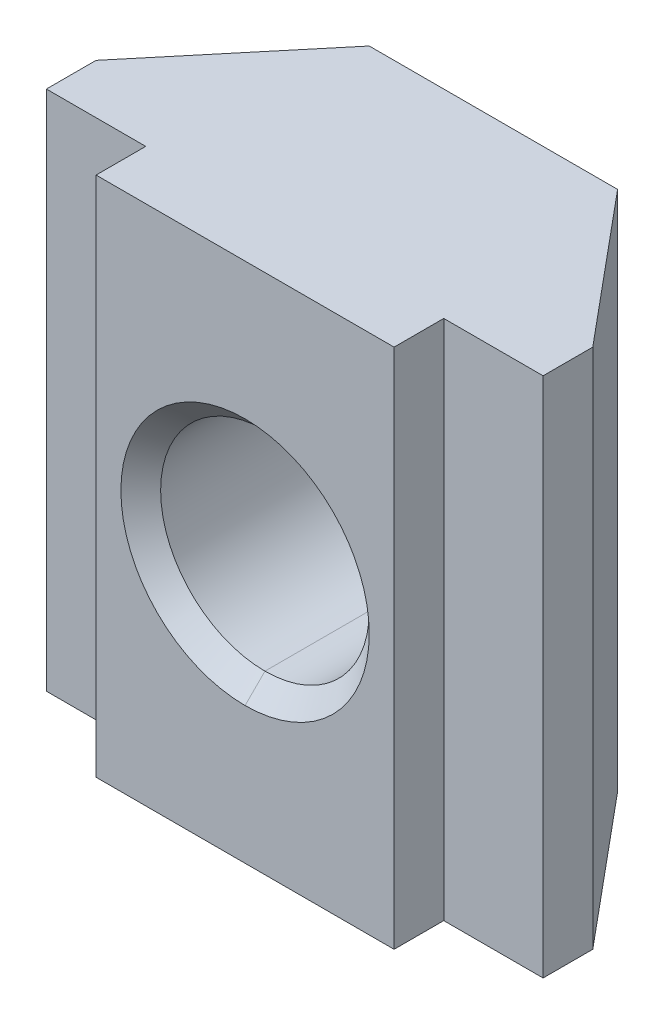
ISO-10303-21;
HEADER;
FILE_DESCRIPTION(('STEP AP214'),'2;1');
FILE_NAME('part.step','',(''),(''),'','','');
FILE_SCHEMA(('AUTOMOTIVE_DESIGN { 1 0 10303 214 1 1 1 1 }'));
ENDSEC;
DATA;
#1=APPLICATION_CONTEXT('core data for automotive mechanical design processes');
#2=APPLICATION_PROTOCOL_DEFINITION('international standard','automotive_design',2000,#1);
#3=PRODUCT_CONTEXT('',#1,'mechanical');
#4=PRODUCT('Part','Part','',(#3));
#5=PRODUCT_RELATED_PRODUCT_CATEGORY('part','',(#4));
#6=PRODUCT_DEFINITION_FORMATION('','',#4);
#7=PRODUCT_DEFINITION_CONTEXT('part definition',#1,'design');
#8=PRODUCT_DEFINITION('design','',#6,#7);
#9=PRODUCT_DEFINITION_SHAPE('','',#8);
#10=(LENGTH_UNIT() NAMED_UNIT(*) SI_UNIT(.MILLI.,.METRE.));
#11=(NAMED_UNIT(*) PLANE_ANGLE_UNIT() SI_UNIT($,.RADIAN.));
#12=(NAMED_UNIT(*) SI_UNIT($,.STERADIAN.) SOLID_ANGLE_UNIT());
#13=UNCERTAINTY_MEASURE_WITH_UNIT(LENGTH_MEASURE(1.E-05),#10,'distance_accuracy_value','');
#14=(GEOMETRIC_REPRESENTATION_CONTEXT(3) GLOBAL_UNCERTAINTY_ASSIGNED_CONTEXT((#13)) GLOBAL_UNIT_ASSIGNED_CONTEXT((#10,
#11,#12)) REPRESENTATION_CONTEXT('',''));
#15=CARTESIAN_POINT('',(0.,0.,0.));
#16=DIRECTION('',(0.,0.,1.));
#17=DIRECTION('',(1.,0.,0.));
#18=AXIS2_PLACEMENT_3D('',#15,#16,#17);
#19=CARTESIAN_POINT('',(5.,5.25,0.));
#20=DIRECTION('',(1.,0.,0.));
#21=DIRECTION('',(0.,1.,0.));
#22=AXIS2_PLACEMENT_3D('',#19,#20,#21);
#23=PLANE('',#22);
#24=DIRECTION('',(0.,-1.,0.));
#25=VECTOR('',#24,1.);
#26=CARTESIAN_POINT('',(5.,5.25,0.));
#27=LINE('',#26,#25);
#28=CARTESIAN_POINT('',(5.,5.25,0.));
#29=VERTEX_POINT('',#28);
#30=CARTESIAN_POINT('',(5.,-5.25,0.));
#31=VERTEX_POINT('',#30);
#32=EDGE_CURVE('E25',#29,#31,#27,.T.);
#33=ORIENTED_EDGE('',*,*,#32,.T.);
#34=DIRECTION('',(0.,0.,-1.));
#35=VECTOR('',#34,1.);
#36=CARTESIAN_POINT('',(5.,-5.25,0.));
#37=LINE('',#36,#35);
#38=CARTESIAN_POINT('',(5.,-5.25,-1.));
#39=VERTEX_POINT('',#38);
#40=EDGE_CURVE('E195',#31,#39,#37,.T.);
#41=ORIENTED_EDGE('',*,*,#40,.T.);
#42=DIRECTION('',(0.,-1.,0.));
#43=VECTOR('',#42,1.);
#44=CARTESIAN_POINT('',(5.,5.25,-1.));
#45=LINE('',#44,#43);
#46=CARTESIAN_POINT('',(5.,5.25,-1.));
#47=VERTEX_POINT('',#46);
#48=EDGE_CURVE('E11',#47,#39,#45,.T.);
#49=ORIENTED_EDGE('',*,*,#48,.F.);
#50=DIRECTION('',(0.,0.,1.));
#51=VECTOR('',#50,1.);
#52=CARTESIAN_POINT('',(5.,5.25,0.));
#53=LINE('',#52,#51);
#54=EDGE_CURVE('E304',#47,#29,#53,.T.);
#55=ORIENTED_EDGE('',*,*,#54,.T.);
#56=EDGE_LOOP('',(#33,#41,#49,#55));
#57=FACE_BOUND('',#56,.T.);
#58=ADVANCED_FACE('F17',(#57),#23,.T.);
#59=CARTESIAN_POINT('',(-5.,5.25,0.));
#60=DIRECTION('',(1.,0.,0.));
#61=DIRECTION('',(0.,1.,0.));
#62=AXIS2_PLACEMENT_3D('',#59,#60,#61);
#63=PLANE('',#62);
#64=DIRECTION('',(0.,0.,-1.));
#65=VECTOR('',#64,1.);
#66=CARTESIAN_POINT('',(-5.,-5.25,0.));
#67=LINE('',#66,#65);
#68=CARTESIAN_POINT('',(-5.,-5.25,0.));
#69=VERTEX_POINT('',#68);
#70=CARTESIAN_POINT('',(-5.,-5.25,-1.));
#71=VERTEX_POINT('',#70);
#72=EDGE_CURVE('E265',#69,#71,#67,.T.);
#73=ORIENTED_EDGE('',*,*,#72,.F.);
#74=DIRECTION('',(0.,1.,0.));
#75=VECTOR('',#74,1.);
#76=CARTESIAN_POINT('',(-5.,5.25,0.));
#77=LINE('',#76,#75);
#78=CARTESIAN_POINT('',(-5.,5.25,0.));
#79=VERTEX_POINT('',#78);
#80=EDGE_CURVE('E312',#69,#79,#77,.T.);
#81=ORIENTED_EDGE('',*,*,#80,.T.);
#82=DIRECTION('',(0.,0.,1.));
#83=VECTOR('',#82,1.);
#84=CARTESIAN_POINT('',(-5.,5.25,0.));
#85=LINE('',#84,#83);
#86=CARTESIAN_POINT('',(-5.,5.25,-1.));
#87=VERTEX_POINT('',#86);
#88=EDGE_CURVE('E290',#87,#79,#85,.T.);
#89=ORIENTED_EDGE('',*,*,#88,.F.);
#90=DIRECTION('',(0.,-1.,0.));
#91=VECTOR('',#90,1.);
#92=CARTESIAN_POINT('',(-5.,5.25,-1.));
#93=LINE('',#92,#91);
#94=EDGE_CURVE('E322',#87,#71,#93,.T.);
#95=ORIENTED_EDGE('',*,*,#94,.T.);
#96=EDGE_LOOP('',(#73,#81,#89,#95));
#97=FACE_BOUND('',#96,.T.);
#98=ADVANCED_FACE('F476',(#97),#63,.F.);
#99=CARTESIAN_POINT('',(0.,0.,-4.00000000013279));
#100=DIRECTION('',(0.,0.,-1.));
#101=DIRECTION('',(0.,1.,0.));
#102=AXIS2_PLACEMENT_3D('',#99,#100,#101);
#103=CONICAL_SURFACE('',#102,2.50000000011141,0.785398163539558);
#104=DIRECTION('',(0.,-0.707106781287035,-0.70710678108606));
#105=VECTOR('',#104,1.);
#106=CARTESIAN_POINT('',(0.,-2.50000000011142,-4.00000000013278));
#107=LINE('',#106,#105);
#108=CARTESIAN_POINT('',(0.,-2.1,-3.6));
#109=VERTEX_POINT('',#108);
#110=CARTESIAN_POINT('',(0.,-2.49999999999773,-4.00000000001909));
#111=VERTEX_POINT('',#110);
#112=EDGE_CURVE('E215',#109,#111,#107,.T.);
#113=ORIENTED_EDGE('',*,*,#112,.F.);
#114=CARTESIAN_POINT('',(0.,0.,-3.6));
#115=DIRECTION('',(0.,0.,1.));
#116=DIRECTION('',(0.,1.,0.));
#117=AXIS2_PLACEMENT_3D('',#114,#115,#116);
#118=CIRCLE('',#117,2.1);
#119=CARTESIAN_POINT('',(0.,2.1,-3.6));
#120=VERTEX_POINT('',#119);
#121=EDGE_CURVE('E303',#109,#120,#118,.T.);
#122=ORIENTED_EDGE('',*,*,#121,.T.);
#123=DIRECTION('',(0.,0.707106781287033,-0.707106781086062));
#124=VECTOR('',#123,1.);
#125=CARTESIAN_POINT('',(0.,2.50000000011141,-4.00000000013279));
#126=LINE('',#125,#124);
#127=CARTESIAN_POINT('',(0.,2.49999999999772,-4.00000000001909));
#128=VERTEX_POINT('',#127);
#129=EDGE_CURVE('E222',#120,#128,#126,.T.);
#130=ORIENTED_EDGE('',*,*,#129,.T.);
#131=CARTESIAN_POINT('',(0.,0.,-4.00000000001909));
#132=DIRECTION('',(0.,0.,-1.));
#133=DIRECTION('',(0.,1.,0.));
#134=AXIS2_PLACEMENT_3D('',#131,#132,#133);
#135=CIRCLE('',#134,2.49999999999772);
#136=CARTESIAN_POINT('',(2.50000000000042,0.,-4.00000000001909));
#137=VERTEX_POINT('',#136);
#138=EDGE_CURVE('E318',#128,#137,#135,.T.);
#139=ORIENTED_EDGE('',*,*,#138,.T.);
#140=EDGE_CURVE('E274',#137,#111,#135,.T.);
#141=ORIENTED_EDGE('',*,*,#140,.T.);
#142=EDGE_LOOP('',(#113,#122,#130,#139,#141));
#143=FACE_BOUND('',#142,.T.);
#144=ADVANCED_FACE('F513',(#143),#103,.F.);
#145=CARTESIAN_POINT('',(5.,5.25,-1.));
#146=DIRECTION('',(0.768221279597458,0.,-0.640184399664382));
#147=DIRECTION('',(0.,-1.,0.));
#148=AXIS2_PLACEMENT_3D('',#145,#146,#147);
#149=PLANE('',#148);
#150=ORIENTED_EDGE('',*,*,#48,.T.);
#151=DIRECTION('',(0.640184399664441,0.,0.768221279597409));
#152=VECTOR('',#151,1.);
#153=CARTESIAN_POINT('',(2.50000000000019,-5.25,-4.00000000000008));
#154=LINE('',#153,#152);
#155=CARTESIAN_POINT('',(2.50000000000031,-5.25,-4.00000000000013));
#156=VERTEX_POINT('',#155);
#157=EDGE_CURVE('E250',#156,#39,#154,.T.);
#158=ORIENTED_EDGE('',*,*,#157,.F.);
#159=DIRECTION('',(0.,1.,0.));
#160=VECTOR('',#159,1.);
#161=CARTESIAN_POINT('',(2.50000000000042,5.25,-4.00000000000028));
#162=LINE('',#161,#160);
#163=CARTESIAN_POINT('',(2.50000000000042,0.,-4.00000000001909));
#164=VERTEX_POINT('',#163);
#165=EDGE_CURVE('E270',#156,#164,#162,.T.);
#166=ORIENTED_EDGE('',*,*,#165,.T.);
#167=CARTESIAN_POINT('',(2.50000000000034,5.25,-4.00000000000007));
#168=VERTEX_POINT('',#167);
#169=EDGE_CURVE('E275',#164,#168,#162,.T.);
#170=ORIENTED_EDGE('',*,*,#169,.T.);
#171=DIRECTION('',(0.640184399664441,0.,0.768221279597408));
#172=VECTOR('',#171,1.);
#173=CARTESIAN_POINT('',(2.50000000000019,5.25,-4.00000000000008));
#174=LINE('',#173,#172);
#175=EDGE_CURVE('E299',#168,#47,#174,.T.);
#176=ORIENTED_EDGE('',*,*,#175,.T.);
#177=EDGE_LOOP('',(#150,#158,#166,#170,#176));
#178=FACE_BOUND('',#177,.T.);
#179=ADVANCED_FACE('F484',(#178),#149,.T.);
#180=CARTESIAN_POINT('',(5.,5.25,0.));
#181=DIRECTION('',(0.,0.,-1.));
#182=DIRECTION('',(0.,-1.,0.));
#183=AXIS2_PLACEMENT_3D('',#180,#181,#182);
#184=PLANE('',#183);
#185=DIRECTION('',(-1.,0.,0.));
#186=VECTOR('',#185,1.);
#187=CARTESIAN_POINT('',(0.,-5.25,0.));
#188=LINE('',#187,#186);
#189=CARTESIAN_POINT('',(3.,-5.25,0.));
#190=VERTEX_POINT('',#189);
#191=EDGE_CURVE('E254',#31,#190,#188,.T.);
#192=ORIENTED_EDGE('',*,*,#191,.F.);
#193=ORIENTED_EDGE('',*,*,#32,.F.);
#194=DIRECTION('',(-1.,0.,0.));
#195=VECTOR('',#194,1.);
#196=CARTESIAN_POINT('',(0.,5.25,0.));
#197=LINE('',#196,#195);
#198=CARTESIAN_POINT('',(3.,5.25,0.));
#199=VERTEX_POINT('',#198);
#200=EDGE_CURVE('E298',#29,#199,#197,.T.);
#201=ORIENTED_EDGE('',*,*,#200,.T.);
#202=DIRECTION('',(0.,-1.,0.));
#203=VECTOR('',#202,1.);
#204=CARTESIAN_POINT('',(3.,5.25,0.));
#205=LINE('',#204,#203);
#206=EDGE_CURVE('E269',#199,#190,#205,.T.);
#207=ORIENTED_EDGE('',*,*,#206,.T.);
#208=EDGE_LOOP('',(#192,#193,#201,#207));
#209=FACE_BOUND('',#208,.T.);
#210=ADVANCED_FACE('F334',(#209),#184,.F.);
#211=CARTESIAN_POINT('',(-5.,5.25,-1.));
#212=DIRECTION('',(0.768221279597458,0.,0.640184399664382));
#213=DIRECTION('',(0.,-1.,0.));
#214=AXIS2_PLACEMENT_3D('',#211,#212,#213);
#215=PLANE('',#214);
#216=DIRECTION('',(0.,-1.,0.));
#217=VECTOR('',#216,1.);
#218=CARTESIAN_POINT('',(-2.50000000000042,5.25,-4.00000000000028));
#219=LINE('',#218,#217);
#220=CARTESIAN_POINT('',(-2.50000000000034,5.25,-4.00000000000007));
#221=VERTEX_POINT('',#220);
#222=CARTESIAN_POINT('',(-2.50000000000042,0.,-4.00000000001909));
#223=VERTEX_POINT('',#222);
#224=EDGE_CURVE('E315',#221,#223,#219,.T.);
#225=ORIENTED_EDGE('',*,*,#224,.T.);
#226=CARTESIAN_POINT('',(-2.50000000000031,-5.25,-4.00000000000013));
#227=VERTEX_POINT('',#226);
#228=EDGE_CURVE('E32',#223,#227,#219,.T.);
#229=ORIENTED_EDGE('',*,*,#228,.T.);
#230=DIRECTION('',(0.640184399664441,0.,-0.768221279597409));
#231=VECTOR('',#230,1.);
#232=CARTESIAN_POINT('',(-5.,-5.25,-1.));
#233=LINE('',#232,#231);
#234=EDGE_CURVE('E242',#71,#227,#233,.T.);
#235=ORIENTED_EDGE('',*,*,#234,.F.);
#236=ORIENTED_EDGE('',*,*,#94,.F.);
#237=DIRECTION('',(0.640184399664441,0.,-0.768221279597408));
#238=VECTOR('',#237,1.);
#239=CARTESIAN_POINT('',(-5.,5.25,-1.));
#240=LINE('',#239,#238);
#241=EDGE_CURVE('E286',#87,#221,#240,.T.);
#242=ORIENTED_EDGE('',*,*,#241,.T.);
#243=EDGE_LOOP('',(#225,#229,#235,#236,#242));
#244=FACE_BOUND('',#243,.T.);
#245=ADVANCED_FACE('F472',(#244),#215,.F.);
#246=CARTESIAN_POINT('',(-2.5,5.25,-4.));
#247=DIRECTION('',(0.,0.,1.));
#248=DIRECTION('',(0.,-1.,0.));
#249=AXIS2_PLACEMENT_3D('',#246,#247,#248);
#250=PLANE('',#249);
#251=ORIENTED_EDGE('',*,*,#138,.F.);
#252=CARTESIAN_POINT('',(0.,0.,-4.00000000001909));
#253=DIRECTION('',(0.,0.,-1.));
#254=DIRECTION('',(0.,1.,0.));
#255=AXIS2_PLACEMENT_3D('',#252,#253,#254);
#256=CIRCLE('',#255,2.49999999999772);
#257=CARTESIAN_POINT('',(-2.50000000000042,0.,-4.00000000001909));
#258=VERTEX_POINT('',#257);
#259=EDGE_CURVE('E40',#258,#128,#256,.T.);
#260=ORIENTED_EDGE('',*,*,#259,.F.);
#261=EDGE_CURVE('E219',#111,#258,#256,.T.);
#262=ORIENTED_EDGE('',*,*,#261,.F.);
#263=ORIENTED_EDGE('',*,*,#140,.F.);
#264=EDGE_LOOP('',(#251,#260,#262,#263));
#265=FACE_BOUND('',#264,.T.);
#266=DIRECTION('',(1.,0.,0.));
#267=VECTOR('',#266,1.);
#268=CARTESIAN_POINT('',(0.,-5.25,-4.00000000000008));
#269=LINE('',#268,#267);
#270=EDGE_CURVE('E246',#227,#156,#269,.T.);
#271=ORIENTED_EDGE('',*,*,#270,.F.);
#272=ORIENTED_EDGE('',*,*,#228,.F.);
#273=ORIENTED_EDGE('',*,*,#224,.F.);
#274=DIRECTION('',(1.,0.,0.));
#275=VECTOR('',#274,1.);
#276=CARTESIAN_POINT('',(-2.5,5.25,-4.));
#277=LINE('',#276,#275);
#278=EDGE_CURVE('E282',#221,#168,#277,.T.);
#279=ORIENTED_EDGE('',*,*,#278,.T.);
#280=ORIENTED_EDGE('',*,*,#169,.F.);
#281=ORIENTED_EDGE('',*,*,#165,.F.);
#282=EDGE_LOOP('',(#271,#272,#273,#279,#280,#281));
#283=FACE_BOUND('',#282,.T.);
#284=ADVANCED_FACE('F473',(#265,#283),#250,.F.);
#285=CARTESIAN_POINT('',(-3.,5.25,0.));
#286=DIRECTION('',(0.,0.,-1.));
#287=DIRECTION('',(0.,-1.,0.));
#288=AXIS2_PLACEMENT_3D('',#285,#286,#287);
#289=PLANE('',#288);
#290=DIRECTION('',(-1.,0.,0.));
#291=VECTOR('',#290,1.);
#292=CARTESIAN_POINT('',(0.,-5.25,0.));
#293=LINE('',#292,#291);
#294=CARTESIAN_POINT('',(-3.,-5.25,0.));
#295=VERTEX_POINT('',#294);
#296=EDGE_CURVE('E261',#295,#69,#293,.T.);
#297=ORIENTED_EDGE('',*,*,#296,.F.);
#298=DIRECTION('',(0.,1.,0.));
#299=VECTOR('',#298,1.);
#300=CARTESIAN_POINT('',(-3.,5.25,0.));
#301=LINE('',#300,#299);
#302=CARTESIAN_POINT('',(-3.,5.25,0.));
#303=VERTEX_POINT('',#302);
#304=EDGE_CURVE('E238',#295,#303,#301,.T.);
#305=ORIENTED_EDGE('',*,*,#304,.T.);
#306=DIRECTION('',(-1.,0.,0.));
#307=VECTOR('',#306,1.);
#308=CARTESIAN_POINT('',(0.,5.25,0.));
#309=LINE('',#308,#307);
#310=EDGE_CURVE('E294',#303,#79,#309,.T.);
#311=ORIENTED_EDGE('',*,*,#310,.T.);
#312=ORIENTED_EDGE('',*,*,#80,.F.);
#313=EDGE_LOOP('',(#297,#305,#311,#312));
#314=FACE_BOUND('',#313,.T.);
#315=ADVANCED_FACE('F496',(#314),#289,.F.);
#316=CARTESIAN_POINT('',(0.,0.,1.));
#317=DIRECTION('',(0.,0.,-1.));
#318=DIRECTION('',(0.,1.,0.));
#319=AXIS2_PLACEMENT_3D('',#316,#317,#318);
#320=CYLINDRICAL_SURFACE('',#319,2.1);
#321=DIRECTION('',(0.,0.,-1.));
#322=VECTOR('',#321,1.);
#323=CARTESIAN_POINT('',(0.,-2.1,1.));
#324=LINE('',#323,#322);
#325=CARTESIAN_POINT('',(0.,-2.09999999992761,0.600000000076762));
#326=VERTEX_POINT('',#325);
#327=EDGE_CURVE('E182',#326,#109,#324,.T.);
#328=ORIENTED_EDGE('',*,*,#327,.F.);
#329=CARTESIAN_POINT('',(0.,0.,0.600000000076759));
#330=DIRECTION('',(0.,0.,1.));
#331=DIRECTION('',(0.,-1.,0.));
#332=AXIS2_PLACEMENT_3D('',#329,#330,#331);
#333=CIRCLE('',#332,2.09999999992761);
#334=CARTESIAN_POINT('',(0.,2.09999999992761,0.600000000076757));
#335=VERTEX_POINT('',#334);
#336=EDGE_CURVE('E171',#326,#335,#333,.T.);
#337=ORIENTED_EDGE('',*,*,#336,.T.);
#338=DIRECTION('',(0.,0.,-1.));
#339=VECTOR('',#338,1.);
#340=CARTESIAN_POINT('',(0.,2.1,1.));
#341=LINE('',#340,#339);
#342=EDGE_CURVE('E211',#335,#120,#341,.T.);
#343=ORIENTED_EDGE('',*,*,#342,.T.);
#344=ORIENTED_EDGE('',*,*,#121,.F.);
#345=EDGE_LOOP('',(#328,#337,#343,#344));
#346=FACE_BOUND('',#345,.T.);
#347=ADVANCED_FACE('F498',(#346),#320,.F.);
#348=CARTESIAN_POINT('',(0.,5.25,-1.250477880476));
#349=DIRECTION('',(0.,-1.,0.));
#350=DIRECTION('',(-1.,0.,0.));
#351=AXIS2_PLACEMENT_3D('',#348,#349,#350);
#352=PLANE('',#351);
#353=ORIENTED_EDGE('',*,*,#278,.F.);
#354=ORIENTED_EDGE('',*,*,#241,.F.);
#355=ORIENTED_EDGE('',*,*,#88,.T.);
#356=ORIENTED_EDGE('',*,*,#310,.F.);
#357=DIRECTION('',(0.,0.,1.));
#358=VECTOR('',#357,1.);
#359=CARTESIAN_POINT('',(-3.,5.25,1.));
#360=LINE('',#359,#358);
#361=CARTESIAN_POINT('',(-3.,5.25,1.));
#362=VERTEX_POINT('',#361);
#363=EDGE_CURVE('E235',#303,#362,#360,.T.);
#364=ORIENTED_EDGE('',*,*,#363,.T.);
#365=DIRECTION('',(1.,0.,0.));
#366=VECTOR('',#365,1.);
#367=CARTESIAN_POINT('',(3.,5.25,1.));
#368=LINE('',#367,#366);
#369=CARTESIAN_POINT('',(3.,5.25,1.));
#370=VERTEX_POINT('',#369);
#371=EDGE_CURVE('E202',#362,#370,#368,.T.);
#372=ORIENTED_EDGE('',*,*,#371,.T.);
#373=DIRECTION('',(0.,0.,-1.));
#374=VECTOR('',#373,1.);
#375=CARTESIAN_POINT('',(3.,5.25,0.));
#376=LINE('',#375,#374);
#377=EDGE_CURVE('E278',#370,#199,#376,.T.);
#378=ORIENTED_EDGE('',*,*,#377,.T.);
#379=ORIENTED_EDGE('',*,*,#200,.F.);
#380=ORIENTED_EDGE('',*,*,#54,.F.);
#381=ORIENTED_EDGE('',*,*,#175,.F.);
#382=EDGE_LOOP('',(#353,#354,#355,#356,#364,#372,#378,#379,#380,#381));
#383=FACE_BOUND('',#382,.T.);
#384=ADVANCED_FACE('F482',(#383),#352,.F.);
#385=CARTESIAN_POINT('',(3.,5.25,0.));
#386=DIRECTION('',(-1.,0.,0.));
#387=DIRECTION('',(0.,0.,1.));
#388=AXIS2_PLACEMENT_3D('',#385,#386,#387);
#389=PLANE('',#388);
#390=DIRECTION('',(0.,0.,1.));
#391=VECTOR('',#390,1.);
#392=CARTESIAN_POINT('',(3.,-5.25,-1.250477880476));
#393=LINE('',#392,#391);
#394=CARTESIAN_POINT('',(3.,-5.25,1.));
#395=VERTEX_POINT('',#394);
#396=EDGE_CURVE('E258',#190,#395,#393,.T.);
#397=ORIENTED_EDGE('',*,*,#396,.F.);
#398=ORIENTED_EDGE('',*,*,#206,.F.);
#399=ORIENTED_EDGE('',*,*,#377,.F.);
#400=DIRECTION('',(0.,-1.,0.));
#401=VECTOR('',#400,1.);
#402=CARTESIAN_POINT('',(3.,5.25,1.));
#403=LINE('',#402,#401);
#404=EDGE_CURVE('E198',#370,#395,#403,.T.);
#405=ORIENTED_EDGE('',*,*,#404,.T.);
#406=EDGE_LOOP('',(#397,#398,#399,#405));
#407=FACE_BOUND('',#406,.T.);
#408=ADVANCED_FACE('F488',(#407),#389,.F.);
#409=CARTESIAN_POINT('',(0.,-5.25,-1.250477880476));
#410=DIRECTION('',(0.,-1.,0.));
#411=DIRECTION('',(-1.,0.,0.));
#412=AXIS2_PLACEMENT_3D('',#409,#410,#411);
#413=PLANE('',#412);
#414=ORIENTED_EDGE('',*,*,#234,.T.);
#415=ORIENTED_EDGE('',*,*,#270,.T.);
#416=ORIENTED_EDGE('',*,*,#157,.T.);
#417=ORIENTED_EDGE('',*,*,#40,.F.);
#418=ORIENTED_EDGE('',*,*,#191,.T.);
#419=ORIENTED_EDGE('',*,*,#396,.T.);
#420=DIRECTION('',(-1.,0.,0.));
#421=VECTOR('',#420,1.);
#422=CARTESIAN_POINT('',(3.,-5.25,1.));
#423=LINE('',#422,#421);
#424=CARTESIAN_POINT('',(-3.,-5.25,1.));
#425=VERTEX_POINT('',#424);
#426=EDGE_CURVE('E203',#395,#425,#423,.T.);
#427=ORIENTED_EDGE('',*,*,#426,.T.);
#428=DIRECTION('',(0.,0.,-1.));
#429=VECTOR('',#428,1.);
#430=CARTESIAN_POINT('',(-3.,-5.25,1.));
#431=LINE('',#430,#429);
#432=EDGE_CURVE('E231',#425,#295,#431,.T.);
#433=ORIENTED_EDGE('',*,*,#432,.T.);
#434=ORIENTED_EDGE('',*,*,#296,.T.);
#435=ORIENTED_EDGE('',*,*,#72,.T.);
#436=EDGE_LOOP('',(#414,#415,#416,#417,#418,#419,#427,#433,#434,#435));
#437=FACE_BOUND('',#436,.T.);
#438=ADVANCED_FACE('F338',(#437),#413,.T.);
#439=CARTESIAN_POINT('',(-3.,5.25,1.));
#440=DIRECTION('',(1.,0.,0.));
#441=DIRECTION('',(0.,1.,0.));
#442=AXIS2_PLACEMENT_3D('',#439,#440,#441);
#443=PLANE('',#442);
#444=ORIENTED_EDGE('',*,*,#432,.F.);
#445=DIRECTION('',(0.,1.,0.));
#446=VECTOR('',#445,1.);
#447=CARTESIAN_POINT('',(-3.,5.25,1.));
#448=LINE('',#447,#446);
#449=EDGE_CURVE('E172',#425,#362,#448,.T.);
#450=ORIENTED_EDGE('',*,*,#449,.T.);
#451=ORIENTED_EDGE('',*,*,#363,.F.);
#452=ORIENTED_EDGE('',*,*,#304,.F.);
#453=EDGE_LOOP('',(#444,#450,#451,#452));
#454=FACE_BOUND('',#453,.T.);
#455=ADVANCED_FACE('F493',(#454),#443,.F.);
#456=CARTESIAN_POINT('',(0.,0.,1.00000000003319));
#457=DIRECTION('',(0.,0.,1.));
#458=DIRECTION('',(0.,-1.,0.));
#459=AXIS2_PLACEMENT_3D('',#456,#457,#458);
#460=CONICAL_SURFACE('',#459,2.49999999994089,0.785398163468503);
#461=DIRECTION('',(0.,0.707106781236792,0.707106781136303));
#462=VECTOR('',#461,1.);
#463=CARTESIAN_POINT('',(0.,2.49999999994089,1.00000000003319));
#464=LINE('',#463,#462);
#465=CARTESIAN_POINT('',(0.,2.49999999999772,1.00000000009003));
#466=VERTEX_POINT('',#465);
#467=EDGE_CURVE('E185',#335,#466,#464,.T.);
#468=ORIENTED_EDGE('',*,*,#467,.F.);
#469=ORIENTED_EDGE('',*,*,#336,.F.);
#470=DIRECTION('',(0.,-0.707106781236791,0.707106781136304));
#471=VECTOR('',#470,1.);
#472=CARTESIAN_POINT('',(0.,-2.49999999994089,1.0000000000332));
#473=LINE('',#472,#471);
#474=CARTESIAN_POINT('',(0.,-2.49999999999772,1.00000000009004));
#475=VERTEX_POINT('',#474);
#476=EDGE_CURVE('E175',#326,#475,#473,.T.);
#477=ORIENTED_EDGE('',*,*,#476,.T.);
#478=CARTESIAN_POINT('',(0.,0.,1.00000000009004));
#479=DIRECTION('',(0.,0.,1.));
#480=DIRECTION('',(0.,-1.,0.));
#481=AXIS2_PLACEMENT_3D('',#478,#479,#480);
#482=CIRCLE('',#481,2.49999999999772);
#483=EDGE_CURVE('E161',#475,#466,#482,.T.);
#484=ORIENTED_EDGE('',*,*,#483,.T.);
#485=EDGE_LOOP('',(#468,#469,#477,#484));
#486=FACE_BOUND('',#485,.T.);
#487=ADVANCED_FACE('F176',(#486),#460,.F.);
#488=CARTESIAN_POINT('',(3.,5.25,1.));
#489=DIRECTION('',(0.,0.,-1.));
#490=DIRECTION('',(0.,-1.,0.));
#491=AXIS2_PLACEMENT_3D('',#488,#489,#490);
#492=PLANE('',#491);
#493=ORIENTED_EDGE('',*,*,#483,.F.);
#494=CARTESIAN_POINT('',(0.,0.,1.00000000009004));
#495=DIRECTION('',(0.,0.,1.));
#496=DIRECTION('',(0.,-1.,0.));
#497=AXIS2_PLACEMENT_3D('',#494,#495,#496);
#498=CIRCLE('',#497,2.49999999999772);
#499=EDGE_CURVE('E166',#466,#475,#498,.T.);
#500=ORIENTED_EDGE('',*,*,#499,.F.);
#501=EDGE_LOOP('',(#493,#500));
#502=FACE_BOUND('',#501,.T.);
#503=ORIENTED_EDGE('',*,*,#426,.F.);
#504=ORIENTED_EDGE('',*,*,#404,.F.);
#505=ORIENTED_EDGE('',*,*,#371,.F.);
#506=ORIENTED_EDGE('',*,*,#449,.F.);
#507=EDGE_LOOP('',(#503,#504,#505,#506));
#508=FACE_BOUND('',#507,.T.);
#509=ADVANCED_FACE('F163',(#502,#508),#492,.F.);
#510=CARTESIAN_POINT('',(0.,0.,-4.00000000013279));
#511=DIRECTION('',(0.,0.,-1.));
#512=DIRECTION('',(0.,1.,0.));
#513=AXIS2_PLACEMENT_3D('',#510,#511,#512);
#514=CONICAL_SURFACE('',#513,2.50000000011141,0.785398163539558);
#515=CARTESIAN_POINT('',(0.,0.,-3.6));
#516=DIRECTION('',(0.,0.,1.));
#517=DIRECTION('',(0.,1.,0.));
#518=AXIS2_PLACEMENT_3D('',#515,#516,#517);
#519=CIRCLE('',#518,2.1);
#520=EDGE_CURVE('E207',#120,#109,#519,.T.);
#521=ORIENTED_EDGE('',*,*,#520,.T.);
#522=ORIENTED_EDGE('',*,*,#112,.T.);
#523=ORIENTED_EDGE('',*,*,#261,.T.);
#524=ORIENTED_EDGE('',*,*,#259,.T.);
#525=ORIENTED_EDGE('',*,*,#129,.F.);
#526=EDGE_LOOP('',(#521,#522,#523,#524,#525));
#527=FACE_BOUND('',#526,.T.);
#528=ADVANCED_FACE('F530',(#527),#514,.F.);
#529=CARTESIAN_POINT('',(0.,0.,1.));
#530=DIRECTION('',(0.,0.,-1.));
#531=DIRECTION('',(0.,1.,0.));
#532=AXIS2_PLACEMENT_3D('',#529,#530,#531);
#533=CYLINDRICAL_SURFACE('',#532,2.1);
#534=CARTESIAN_POINT('',(0.,0.,0.600000000076759));
#535=DIRECTION('',(0.,0.,1.));
#536=DIRECTION('',(0.,-1.,0.));
#537=AXIS2_PLACEMENT_3D('',#534,#535,#536);
#538=CIRCLE('',#537,2.09999999992761);
#539=EDGE_CURVE('E192',#335,#326,#538,.T.);
#540=ORIENTED_EDGE('',*,*,#539,.T.);
#541=ORIENTED_EDGE('',*,*,#327,.T.);
#542=ORIENTED_EDGE('',*,*,#520,.F.);
#543=ORIENTED_EDGE('',*,*,#342,.F.);
#544=EDGE_LOOP('',(#540,#541,#542,#543));
#545=FACE_BOUND('',#544,.T.);
#546=ADVANCED_FACE('F533',(#545),#533,.F.);
#547=CARTESIAN_POINT('',(0.,0.,1.00000000003319));
#548=DIRECTION('',(0.,0.,1.));
#549=DIRECTION('',(0.,-1.,0.));
#550=AXIS2_PLACEMENT_3D('',#547,#548,#549);
#551=CONICAL_SURFACE('',#550,2.49999999994089,0.785398163468503);
#552=ORIENTED_EDGE('',*,*,#539,.F.);
#553=ORIENTED_EDGE('',*,*,#467,.T.);
#554=ORIENTED_EDGE('',*,*,#499,.T.);
#555=ORIENTED_EDGE('',*,*,#476,.F.);
#556=EDGE_LOOP('',(#552,#553,#554,#555));
#557=FACE_BOUND('',#556,.T.);
#558=ADVANCED_FACE('F184',(#557),#551,.F.);
#559=CLOSED_SHELL('',(#58,#98,#144,#179,#210,#245,#284,#315,#347,#384,#408,#438,#455,#487,#509,
#528,#546,#558));
#560=MANIFOLD_SOLID_BREP('B1',#559);
#561=ADVANCED_BREP_SHAPE_REPRESENTATION('',(#18,#560),#14);
#562=SHAPE_DEFINITION_REPRESENTATION(#9,#561);
ENDSEC;
END-ISO-10303-21;
